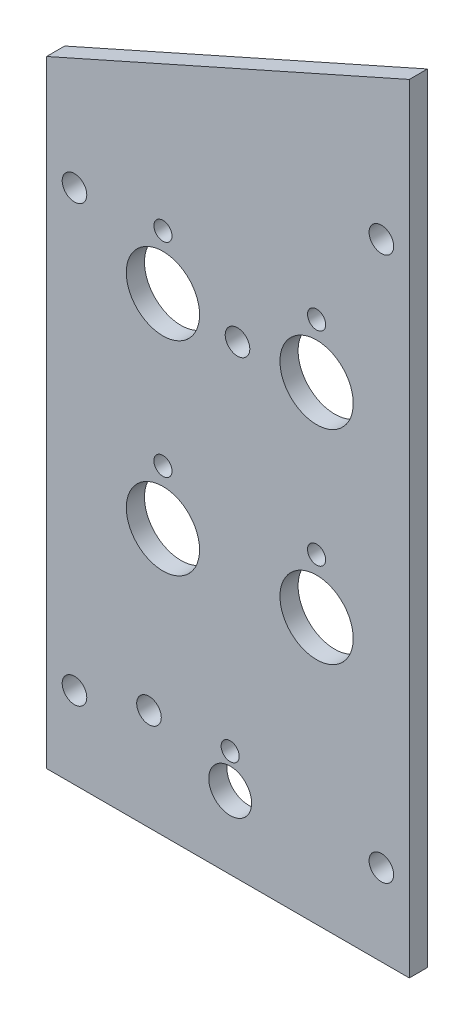
ISO-10303-21;
HEADER;
FILE_DESCRIPTION(('STEP AP214'),'2;1');
FILE_NAME('part.step','',(''),(''),'','','');
FILE_SCHEMA(('AUTOMOTIVE_DESIGN { 1 0 10303 214 1 1 1 1 }'));
ENDSEC;
DATA;
#1=APPLICATION_CONTEXT('core data for automotive mechanical design processes');
#2=APPLICATION_PROTOCOL_DEFINITION('international standard','automotive_design',2000,#1);
#3=PRODUCT_CONTEXT('',#1,'mechanical');
#4=PRODUCT('Part','Part','',(#3));
#5=PRODUCT_RELATED_PRODUCT_CATEGORY('part','',(#4));
#6=PRODUCT_DEFINITION_FORMATION('','',#4);
#7=PRODUCT_DEFINITION_CONTEXT('part definition',#1,'design');
#8=PRODUCT_DEFINITION('design','',#6,#7);
#9=PRODUCT_DEFINITION_SHAPE('','',#8);
#10=(LENGTH_UNIT() NAMED_UNIT(*) SI_UNIT(.MILLI.,.METRE.));
#11=(NAMED_UNIT(*) PLANE_ANGLE_UNIT() SI_UNIT($,.RADIAN.));
#12=(NAMED_UNIT(*) SI_UNIT($,.STERADIAN.) SOLID_ANGLE_UNIT());
#13=UNCERTAINTY_MEASURE_WITH_UNIT(LENGTH_MEASURE(1.E-05),#10,'distance_accuracy_value','');
#14=(GEOMETRIC_REPRESENTATION_CONTEXT(3) GLOBAL_UNCERTAINTY_ASSIGNED_CONTEXT((#13)) GLOBAL_UNIT_ASSIGNED_CONTEXT((#10,
#11,#12)) REPRESENTATION_CONTEXT('',''));
#15=CARTESIAN_POINT('',(0.,0.,0.));
#16=DIRECTION('',(0.,0.,1.));
#17=DIRECTION('',(1.,0.,0.));
#18=AXIS2_PLACEMENT_3D('',#15,#16,#17);
#19=CARTESIAN_POINT('',(63.5,136.2202,-3.175));
#20=DIRECTION('',(-0.406714772664201,0.913555194663523,0.));
#21=DIRECTION('',(-0.913555194663523,-0.406714772664201,0.));
#22=AXIS2_PLACEMENT_3D('',#19,#20,#21);
#23=PLANE('',#22);
#24=DIRECTION('',(-0.913555194663523,-0.406714772664201,0.));
#25=VECTOR('',#24,1.);
#26=CARTESIAN_POINT('',(63.5,136.2202,0.));
#27=LINE('',#26,#25);
#28=CARTESIAN_POINT('',(63.5,136.2202,0.));
#29=VERTEX_POINT('',#28);
#30=CARTESIAN_POINT('',(0.,107.95,0.));
#31=VERTEX_POINT('',#30);
#32=EDGE_CURVE('E105',#29,#31,#27,.T.);
#33=ORIENTED_EDGE('',*,*,#32,.F.);
#34=DIRECTION('',(0.,0.,1.));
#35=VECTOR('',#34,1.);
#36=CARTESIAN_POINT('',(63.5,136.2202,-3.175));
#37=LINE('',#36,#35);
#38=CARTESIAN_POINT('',(63.5,136.2202,-3.175));
#39=VERTEX_POINT('',#38);
#40=EDGE_CURVE('E11',#39,#29,#37,.T.);
#41=ORIENTED_EDGE('',*,*,#40,.F.);
#42=DIRECTION('',(-0.913555194663523,-0.406714772664201,0.));
#43=VECTOR('',#42,1.);
#44=CARTESIAN_POINT('',(63.5,136.2202,-3.175));
#45=LINE('',#44,#43);
#46=CARTESIAN_POINT('',(0.,107.95,-3.175));
#47=VERTEX_POINT('',#46);
#48=EDGE_CURVE('E98',#39,#47,#45,.T.);
#49=ORIENTED_EDGE('',*,*,#48,.T.);
#50=DIRECTION('',(0.,0.,1.));
#51=VECTOR('',#50,1.);
#52=CARTESIAN_POINT('',(0.,107.95,-3.175));
#53=LINE('',#52,#51);
#54=EDGE_CURVE('E43',#47,#31,#53,.T.);
#55=ORIENTED_EDGE('',*,*,#54,.T.);
#56=EDGE_LOOP('',(#33,#41,#49,#55));
#57=FACE_BOUND('',#56,.T.);
#58=ADVANCED_FACE('F40',(#57),#23,.T.);
#59=CARTESIAN_POINT('',(63.5,0.,-3.175));
#60=DIRECTION('',(1.,0.,0.));
#61=DIRECTION('',(0.,0.,-1.));
#62=AXIS2_PLACEMENT_3D('',#59,#60,#61);
#63=PLANE('',#62);
#64=DIRECTION('',(0.,1.,0.));
#65=VECTOR('',#64,1.);
#66=CARTESIAN_POINT('',(63.5,0.,0.));
#67=LINE('',#66,#65);
#68=CARTESIAN_POINT('',(63.5,0.,0.));
#69=VERTEX_POINT('',#68);
#70=EDGE_CURVE('E100',#69,#29,#67,.T.);
#71=ORIENTED_EDGE('',*,*,#70,.F.);
#72=DIRECTION('',(0.,0.,1.));
#73=VECTOR('',#72,1.);
#74=CARTESIAN_POINT('',(63.5,0.,-3.175));
#75=LINE('',#74,#73);
#76=CARTESIAN_POINT('',(63.5,0.,-3.175));
#77=VERTEX_POINT('',#76);
#78=EDGE_CURVE('E49',#77,#69,#75,.T.);
#79=ORIENTED_EDGE('',*,*,#78,.F.);
#80=DIRECTION('',(0.,1.,0.));
#81=VECTOR('',#80,1.);
#82=CARTESIAN_POINT('',(63.5,0.,-3.175));
#83=LINE('',#82,#81);
#84=EDGE_CURVE('E95',#77,#39,#83,.T.);
#85=ORIENTED_EDGE('',*,*,#84,.T.);
#86=ORIENTED_EDGE('',*,*,#40,.T.);
#87=EDGE_LOOP('',(#71,#79,#85,#86));
#88=FACE_BOUND('',#87,.T.);
#89=ADVANCED_FACE('F116',(#88),#63,.T.);
#90=CARTESIAN_POINT('',(0.,0.,-3.175));
#91=DIRECTION('',(0.,-1.,0.));
#92=DIRECTION('',(0.,0.,-1.));
#93=AXIS2_PLACEMENT_3D('',#90,#91,#92);
#94=PLANE('',#93);
#95=DIRECTION('',(1.,0.,0.));
#96=VECTOR('',#95,1.);
#97=CARTESIAN_POINT('',(0.,0.,0.));
#98=LINE('',#97,#96);
#99=CARTESIAN_POINT('',(0.,0.,0.));
#100=VERTEX_POINT('',#99);
#101=EDGE_CURVE('E90',#100,#69,#98,.T.);
#102=ORIENTED_EDGE('',*,*,#101,.F.);
#103=DIRECTION('',(0.,0.,1.));
#104=VECTOR('',#103,1.);
#105=CARTESIAN_POINT('',(0.,0.,-3.175));
#106=LINE('',#105,#104);
#107=CARTESIAN_POINT('',(0.,0.,-3.175));
#108=VERTEX_POINT('',#107);
#109=EDGE_CURVE('E85',#108,#100,#106,.T.);
#110=ORIENTED_EDGE('',*,*,#109,.F.);
#111=DIRECTION('',(1.,0.,0.));
#112=VECTOR('',#111,1.);
#113=CARTESIAN_POINT('',(0.,0.,-3.175));
#114=LINE('',#113,#112);
#115=EDGE_CURVE('E88',#108,#77,#114,.T.);
#116=ORIENTED_EDGE('',*,*,#115,.T.);
#117=ORIENTED_EDGE('',*,*,#78,.T.);
#118=EDGE_LOOP('',(#102,#110,#116,#117));
#119=FACE_BOUND('',#118,.T.);
#120=ADVANCED_FACE('F87',(#119),#94,.T.);
#121=CARTESIAN_POINT('',(0.,107.95,-3.175));
#122=DIRECTION('',(-1.,0.,0.));
#123=DIRECTION('',(0.,-1.,0.));
#124=AXIS2_PLACEMENT_3D('',#121,#122,#123);
#125=PLANE('',#124);
#126=DIRECTION('',(0.,-1.,0.));
#127=VECTOR('',#126,1.);
#128=CARTESIAN_POINT('',(0.,107.95,0.));
#129=LINE('',#128,#127);
#130=EDGE_CURVE('E108',#31,#100,#129,.T.);
#131=ORIENTED_EDGE('',*,*,#130,.F.);
#132=ORIENTED_EDGE('',*,*,#54,.F.);
#133=DIRECTION('',(0.,-1.,0.));
#134=VECTOR('',#133,1.);
#135=CARTESIAN_POINT('',(0.,107.95,-3.175));
#136=LINE('',#135,#134);
#137=EDGE_CURVE('E94',#47,#108,#136,.T.);
#138=ORIENTED_EDGE('',*,*,#137,.T.);
#139=ORIENTED_EDGE('',*,*,#109,.T.);
#140=EDGE_LOOP('',(#131,#132,#138,#139));
#141=FACE_BOUND('',#140,.T.);
#142=ADVANCED_FACE('F97',(#141),#125,.T.);
#143=CARTESIAN_POINT('',(0.,0.,-3.175));
#144=DIRECTION('',(0.,0.,1.));
#145=DIRECTION('',(1.,0.,0.));
#146=AXIS2_PLACEMENT_3D('',#143,#144,#145);
#147=PLANE('',#146);
#148=CARTESIAN_POINT('',(33.4263312126926,81.3833913233974,-3.175));
#149=DIRECTION('',(0.,0.,1.));
#150=DIRECTION('',(1.,0.,0.));
#151=AXIS2_PLACEMENT_3D('',#148,#149,#150);
#152=CIRCLE('',#151,2.15264999999999);
#153=CARTESIAN_POINT('',(35.5789812126926,81.3833913233974,-3.175));
#154=VERTEX_POINT('',#153);
#155=EDGE_CURVE('E209',#154,#154,#152,.T.);
#156=ORIENTED_EDGE('',*,*,#155,.T.);
#157=EDGE_LOOP('',(#156));
#158=FACE_BOUND('',#157,.T.);
#159=CARTESIAN_POINT('',(17.9313039319536,17.7712279582032,-3.175));
#160=DIRECTION('',(0.,0.,1.));
#161=DIRECTION('',(1.,0.,0.));
#162=AXIS2_PLACEMENT_3D('',#159,#160,#161);
#163=CIRCLE('',#162,2.15265);
#164=CARTESIAN_POINT('',(20.0839539319536,17.7712279582032,-3.175));
#165=VERTEX_POINT('',#164);
#166=EDGE_CURVE('E211',#165,#165,#163,.T.);
#167=ORIENTED_EDGE('',*,*,#166,.T.);
#168=EDGE_LOOP('',(#167));
#169=FACE_BOUND('',#168,.T.);
#170=CARTESIAN_POINT('',(20.3732306178551,91.7104238503903,-3.175));
#171=DIRECTION('',(0.,0.,1.));
#172=DIRECTION('',(1.,0.,0.));
#173=AXIS2_PLACEMENT_3D('',#170,#171,#172);
#174=CIRCLE('',#173,1.5875);
#175=CARTESIAN_POINT('',(21.9607306178551,91.7104238503903,-3.175));
#176=VERTEX_POINT('',#175);
#177=EDGE_CURVE('E245',#176,#176,#174,.T.);
#178=ORIENTED_EDGE('',*,*,#177,.T.);
#179=EDGE_LOOP('',(#178));
#180=FACE_BOUND('',#179,.T.);
#181=CARTESIAN_POINT('',(47.270485985733,56.0730061512906,-3.175));
#182=DIRECTION('',(0.,0.,1.));
#183=DIRECTION('',(1.,0.,0.));
#184=AXIS2_PLACEMENT_3D('',#181,#182,#183);
#185=CIRCLE('',#184,1.5875);
#186=CARTESIAN_POINT('',(48.857985985733,56.0730061512906,-3.175));
#187=VERTEX_POINT('',#186);
#188=EDGE_CURVE('E246',#187,#187,#185,.T.);
#189=ORIENTED_EDGE('',*,*,#188,.T.);
#190=EDGE_LOOP('',(#189));
#191=FACE_BOUND('',#190,.T.);
#192=CARTESIAN_POINT('',(20.3732306178551,56.0730061512906,-3.175));
#193=DIRECTION('',(0.,0.,1.));
#194=DIRECTION('',(1.,0.,0.));
#195=AXIS2_PLACEMENT_3D('',#192,#193,#194);
#196=CIRCLE('',#195,1.5875);
#197=CARTESIAN_POINT('',(21.9607306178551,56.0730061512906,-3.175));
#198=VERTEX_POINT('',#197);
#199=EDGE_CURVE('E253',#198,#198,#196,.T.);
#200=ORIENTED_EDGE('',*,*,#199,.T.);
#201=EDGE_LOOP('',(#200));
#202=FACE_BOUND('',#201,.T.);
#203=CARTESIAN_POINT('',(32.1439032,18.7,-3.175));
#204=DIRECTION('',(0.,0.,1.));
#205=DIRECTION('',(1.,0.,0.));
#206=AXIS2_PLACEMENT_3D('',#203,#204,#205);
#207=CIRCLE('',#206,1.5875);
#208=CARTESIAN_POINT('',(33.7314032,18.7,-3.175));
#209=VERTEX_POINT('',#208);
#210=EDGE_CURVE('E259',#209,#209,#207,.T.);
#211=ORIENTED_EDGE('',*,*,#210,.T.);
#212=EDGE_LOOP('',(#211));
#213=FACE_BOUND('',#212,.T.);
#214=CARTESIAN_POINT('',(32.1439032,12.7,-3.175));
#215=DIRECTION('',(0.,0.,1.));
#216=DIRECTION('',(1.,0.,0.));
#217=AXIS2_PLACEMENT_3D('',#214,#215,#216);
#218=CIRCLE('',#217,3.75000000000001);
#219=CARTESIAN_POINT('',(35.8939032,12.7,-3.175));
#220=VERTEX_POINT('',#219);
#221=EDGE_CURVE('E265',#220,#220,#218,.T.);
#222=ORIENTED_EDGE('',*,*,#221,.T.);
#223=EDGE_LOOP('',(#222));
#224=FACE_BOUND('',#223,.T.);
#225=CARTESIAN_POINT('',(47.270485985733,46.5480061512906,-3.175));
#226=DIRECTION('',(0.,0.,1.));
#227=DIRECTION('',(1.,0.,0.));
#228=AXIS2_PLACEMENT_3D('',#225,#226,#227);
#229=CIRCLE('',#228,6.4135);
#230=CARTESIAN_POINT('',(53.683985985733,46.5480061512906,-3.175));
#231=VERTEX_POINT('',#230);
#232=EDGE_CURVE('E220',#231,#231,#229,.T.);
#233=ORIENTED_EDGE('',*,*,#232,.T.);
#234=EDGE_LOOP('',(#233));
#235=FACE_BOUND('',#234,.T.);
#236=CARTESIAN_POINT('',(47.270485985733,82.1854238503903,-3.175));
#237=DIRECTION('',(0.,0.,1.));
#238=DIRECTION('',(1.,0.,0.));
#239=AXIS2_PLACEMENT_3D('',#236,#237,#238);
#240=CIRCLE('',#239,6.4135);
#241=CARTESIAN_POINT('',(53.683985985733,82.1854238503903,-3.175));
#242=VERTEX_POINT('',#241);
#243=EDGE_CURVE('E227',#242,#242,#240,.T.);
#244=ORIENTED_EDGE('',*,*,#243,.T.);
#245=EDGE_LOOP('',(#244));
#246=FACE_BOUND('',#245,.T.);
#247=CARTESIAN_POINT('',(20.3732306178551,82.1854238503903,-3.175));
#248=DIRECTION('',(0.,0.,1.));
#249=DIRECTION('',(1.,0.,0.));
#250=AXIS2_PLACEMENT_3D('',#247,#248,#249);
#251=CIRCLE('',#250,6.41350000000002);
#252=CARTESIAN_POINT('',(26.7867306178551,82.1854238503903,-3.175));
#253=VERTEX_POINT('',#252);
#254=EDGE_CURVE('E233',#253,#253,#251,.T.);
#255=ORIENTED_EDGE('',*,*,#254,.T.);
#256=EDGE_LOOP('',(#255));
#257=FACE_BOUND('',#256,.T.);
#258=CARTESIAN_POINT('',(20.3732306178551,46.5480061512906,-3.175));
#259=DIRECTION('',(0.,0.,1.));
#260=DIRECTION('',(1.,0.,0.));
#261=AXIS2_PLACEMENT_3D('',#258,#259,#260);
#262=CIRCLE('',#261,6.4135);
#263=CARTESIAN_POINT('',(26.7867306178551,46.5480061512906,-3.175));
#264=VERTEX_POINT('',#263);
#265=EDGE_CURVE('E239',#264,#264,#262,.T.);
#266=ORIENTED_EDGE('',*,*,#265,.T.);
#267=EDGE_LOOP('',(#266));
#268=FACE_BOUND('',#267,.T.);
#269=CARTESIAN_POINT('',(47.270485985733,91.7104238503903,-3.175));
#270=DIRECTION('',(0.,0.,1.));
#271=DIRECTION('',(1.,0.,0.));
#272=AXIS2_PLACEMENT_3D('',#269,#270,#271);
#273=CIRCLE('',#272,1.5875);
#274=CARTESIAN_POINT('',(48.857985985733,91.7104238503903,-3.175));
#275=VERTEX_POINT('',#274);
#276=EDGE_CURVE('E274',#275,#275,#273,.T.);
#277=ORIENTED_EDGE('',*,*,#276,.T.);
#278=EDGE_LOOP('',(#277));
#279=FACE_BOUND('',#278,.T.);
#280=CARTESIAN_POINT('',(58.6105,14.2875,-3.175));
#281=DIRECTION('',(0.,0.,1.));
#282=DIRECTION('',(1.,0.,0.));
#283=AXIS2_PLACEMENT_3D('',#280,#281,#282);
#284=CIRCLE('',#283,2.15265);
#285=CARTESIAN_POINT('',(60.76315,14.2875,-3.175));
#286=VERTEX_POINT('',#285);
#287=EDGE_CURVE('E282',#286,#286,#284,.T.);
#288=ORIENTED_EDGE('',*,*,#287,.T.);
#289=EDGE_LOOP('',(#288));
#290=FACE_BOUND('',#289,.T.);
#291=CARTESIAN_POINT('',(4.8895,14.2875,-3.175));
#292=DIRECTION('',(0.,0.,1.));
#293=DIRECTION('',(1.,0.,0.));
#294=AXIS2_PLACEMENT_3D('',#291,#292,#293);
#295=CIRCLE('',#294,2.15265);
#296=CARTESIAN_POINT('',(7.04215,14.2875,-3.175));
#297=VERTEX_POINT('',#296);
#298=EDGE_CURVE('E288',#297,#297,#295,.T.);
#299=ORIENTED_EDGE('',*,*,#298,.T.);
#300=EDGE_LOOP('',(#299));
#301=FACE_BOUND('',#300,.T.);
#302=CARTESIAN_POINT('',(4.8895,90.4875,-3.175));
#303=DIRECTION('',(0.,0.,1.));
#304=DIRECTION('',(1.,0.,0.));
#305=AXIS2_PLACEMENT_3D('',#302,#303,#304);
#306=CIRCLE('',#305,2.15265);
#307=CARTESIAN_POINT('',(7.04215,90.4875,-3.175));
#308=VERTEX_POINT('',#307);
#309=EDGE_CURVE('E294',#308,#308,#306,.T.);
#310=ORIENTED_EDGE('',*,*,#309,.T.);
#311=EDGE_LOOP('',(#310));
#312=FACE_BOUND('',#311,.T.);
#313=CARTESIAN_POINT('',(58.6105,109.5375,-3.175));
#314=DIRECTION('',(0.,0.,1.));
#315=DIRECTION('',(1.,0.,0.));
#316=AXIS2_PLACEMENT_3D('',#313,#314,#315);
#317=CIRCLE('',#316,2.15265);
#318=CARTESIAN_POINT('',(60.76315,109.5375,-3.175));
#319=VERTEX_POINT('',#318);
#320=EDGE_CURVE('E109',#319,#319,#317,.T.);
#321=ORIENTED_EDGE('',*,*,#320,.T.);
#322=EDGE_LOOP('',(#321));
#323=FACE_BOUND('',#322,.T.);
#324=ORIENTED_EDGE('',*,*,#48,.F.);
#325=ORIENTED_EDGE('',*,*,#84,.F.);
#326=ORIENTED_EDGE('',*,*,#115,.F.);
#327=ORIENTED_EDGE('',*,*,#137,.F.);
#328=EDGE_LOOP('',(#324,#325,#326,#327));
#329=FACE_BOUND('',#328,.T.);
#330=ADVANCED_FACE('F93',(#158,#169,#180,#191,#202,#213,#224,#235,#246,#257,#268,#279,#290,#301,
#312,#323,#329),#147,.F.);
#331=CARTESIAN_POINT('',(0.,0.,0.));
#332=DIRECTION('',(0.,0.,1.));
#333=DIRECTION('',(1.,0.,0.));
#334=AXIS2_PLACEMENT_3D('',#331,#332,#333);
#335=PLANE('',#334);
#336=CARTESIAN_POINT('',(33.4263312126926,81.3833913233974,0.));
#337=DIRECTION('',(0.,0.,1.));
#338=DIRECTION('',(1.,0.,0.));
#339=AXIS2_PLACEMENT_3D('',#336,#337,#338);
#340=CIRCLE('',#339,2.15264999999999);
#341=CARTESIAN_POINT('',(35.5789812126926,81.3833913233974,0.));
#342=VERTEX_POINT('',#341);
#343=EDGE_CURVE('E207',#342,#342,#340,.T.);
#344=ORIENTED_EDGE('',*,*,#343,.F.);
#345=EDGE_LOOP('',(#344));
#346=FACE_BOUND('',#345,.T.);
#347=CARTESIAN_POINT('',(17.9313039319536,17.7712279582032,0.));
#348=DIRECTION('',(0.,0.,1.));
#349=DIRECTION('',(1.,0.,0.));
#350=AXIS2_PLACEMENT_3D('',#347,#348,#349);
#351=CIRCLE('',#350,2.15264999999999);
#352=CARTESIAN_POINT('',(20.0839539319536,17.7712279582032,0.));
#353=VERTEX_POINT('',#352);
#354=EDGE_CURVE('E216',#353,#353,#351,.T.);
#355=ORIENTED_EDGE('',*,*,#354,.F.);
#356=EDGE_LOOP('',(#355));
#357=FACE_BOUND('',#356,.T.);
#358=CARTESIAN_POINT('',(20.3732306178551,91.7104238503903,0.));
#359=DIRECTION('',(0.,0.,1.));
#360=DIRECTION('',(1.,0.,0.));
#361=AXIS2_PLACEMENT_3D('',#358,#359,#360);
#362=CIRCLE('',#361,1.5875);
#363=CARTESIAN_POINT('',(21.9607306178551,91.7104238503903,0.));
#364=VERTEX_POINT('',#363);
#365=EDGE_CURVE('E219',#364,#364,#362,.T.);
#366=ORIENTED_EDGE('',*,*,#365,.F.);
#367=EDGE_LOOP('',(#366));
#368=FACE_BOUND('',#367,.T.);
#369=CARTESIAN_POINT('',(47.270485985733,56.0730061512906,0.));
#370=DIRECTION('',(0.,0.,1.));
#371=DIRECTION('',(1.,0.,0.));
#372=AXIS2_PLACEMENT_3D('',#369,#370,#371);
#373=CIRCLE('',#372,1.5875);
#374=CARTESIAN_POINT('',(48.857985985733,56.0730061512906,0.));
#375=VERTEX_POINT('',#374);
#376=EDGE_CURVE('E250',#375,#375,#373,.T.);
#377=ORIENTED_EDGE('',*,*,#376,.F.);
#378=EDGE_LOOP('',(#377));
#379=FACE_BOUND('',#378,.T.);
#380=CARTESIAN_POINT('',(20.3732306178551,56.0730061512906,0.));
#381=DIRECTION('',(0.,0.,1.));
#382=DIRECTION('',(1.,0.,0.));
#383=AXIS2_PLACEMENT_3D('',#380,#381,#382);
#384=CIRCLE('',#383,1.5875);
#385=CARTESIAN_POINT('',(21.9607306178551,56.0730061512906,0.));
#386=VERTEX_POINT('',#385);
#387=EDGE_CURVE('E256',#386,#386,#384,.T.);
#388=ORIENTED_EDGE('',*,*,#387,.F.);
#389=EDGE_LOOP('',(#388));
#390=FACE_BOUND('',#389,.T.);
#391=CARTESIAN_POINT('',(32.1439032,18.7,0.));
#392=DIRECTION('',(0.,0.,1.));
#393=DIRECTION('',(1.,0.,0.));
#394=AXIS2_PLACEMENT_3D('',#391,#392,#393);
#395=CIRCLE('',#394,1.5875);
#396=CARTESIAN_POINT('',(33.7314032,18.7,0.));
#397=VERTEX_POINT('',#396);
#398=EDGE_CURVE('E262',#397,#397,#395,.T.);
#399=ORIENTED_EDGE('',*,*,#398,.F.);
#400=EDGE_LOOP('',(#399));
#401=FACE_BOUND('',#400,.T.);
#402=CARTESIAN_POINT('',(32.1439032,12.7,0.));
#403=DIRECTION('',(0.,0.,1.));
#404=DIRECTION('',(1.,0.,0.));
#405=AXIS2_PLACEMENT_3D('',#402,#403,#404);
#406=CIRCLE('',#405,3.75000000000001);
#407=CARTESIAN_POINT('',(35.8939032,12.7,0.));
#408=VERTEX_POINT('',#407);
#409=EDGE_CURVE('E223',#408,#408,#406,.T.);
#410=ORIENTED_EDGE('',*,*,#409,.F.);
#411=EDGE_LOOP('',(#410));
#412=FACE_BOUND('',#411,.T.);
#413=CARTESIAN_POINT('',(47.270485985733,46.5480061512906,0.));
#414=DIRECTION('',(0.,0.,1.));
#415=DIRECTION('',(1.,0.,0.));
#416=AXIS2_PLACEMENT_3D('',#413,#414,#415);
#417=CIRCLE('',#416,6.4135);
#418=CARTESIAN_POINT('',(53.683985985733,46.5480061512906,0.));
#419=VERTEX_POINT('',#418);
#420=EDGE_CURVE('E224',#419,#419,#417,.T.);
#421=ORIENTED_EDGE('',*,*,#420,.F.);
#422=EDGE_LOOP('',(#421));
#423=FACE_BOUND('',#422,.T.);
#424=CARTESIAN_POINT('',(47.270485985733,82.1854238503903,0.));
#425=DIRECTION('',(0.,0.,1.));
#426=DIRECTION('',(1.,0.,0.));
#427=AXIS2_PLACEMENT_3D('',#424,#425,#426);
#428=CIRCLE('',#427,6.4135);
#429=CARTESIAN_POINT('',(53.683985985733,82.1854238503903,0.));
#430=VERTEX_POINT('',#429);
#431=EDGE_CURVE('E230',#430,#430,#428,.T.);
#432=ORIENTED_EDGE('',*,*,#431,.F.);
#433=EDGE_LOOP('',(#432));
#434=FACE_BOUND('',#433,.T.);
#435=CARTESIAN_POINT('',(20.3732306178551,82.1854238503903,0.));
#436=DIRECTION('',(0.,0.,1.));
#437=DIRECTION('',(1.,0.,0.));
#438=AXIS2_PLACEMENT_3D('',#435,#436,#437);
#439=CIRCLE('',#438,6.41350000000002);
#440=CARTESIAN_POINT('',(26.7867306178551,82.1854238503903,0.));
#441=VERTEX_POINT('',#440);
#442=EDGE_CURVE('E236',#441,#441,#439,.T.);
#443=ORIENTED_EDGE('',*,*,#442,.F.);
#444=EDGE_LOOP('',(#443));
#445=FACE_BOUND('',#444,.T.);
#446=CARTESIAN_POINT('',(20.3732306178551,46.5480061512906,0.));
#447=DIRECTION('',(0.,0.,1.));
#448=DIRECTION('',(1.,0.,0.));
#449=AXIS2_PLACEMENT_3D('',#446,#447,#448);
#450=CIRCLE('',#449,6.4135);
#451=CARTESIAN_POINT('',(26.7867306178551,46.5480061512906,0.));
#452=VERTEX_POINT('',#451);
#453=EDGE_CURVE('E242',#452,#452,#450,.T.);
#454=ORIENTED_EDGE('',*,*,#453,.F.);
#455=EDGE_LOOP('',(#454));
#456=FACE_BOUND('',#455,.T.);
#457=CARTESIAN_POINT('',(47.270485985733,91.7104238503903,0.));
#458=DIRECTION('',(0.,0.,1.));
#459=DIRECTION('',(1.,0.,0.));
#460=AXIS2_PLACEMENT_3D('',#457,#458,#459);
#461=CIRCLE('',#460,1.5875);
#462=CARTESIAN_POINT('',(48.857985985733,91.7104238503903,0.));
#463=VERTEX_POINT('',#462);
#464=EDGE_CURVE('E249',#463,#463,#461,.T.);
#465=ORIENTED_EDGE('',*,*,#464,.F.);
#466=EDGE_LOOP('',(#465));
#467=FACE_BOUND('',#466,.T.);
#468=CARTESIAN_POINT('',(58.6105,14.2875,0.));
#469=DIRECTION('',(0.,0.,1.));
#470=DIRECTION('',(1.,0.,0.));
#471=AXIS2_PLACEMENT_3D('',#468,#469,#470);
#472=CIRCLE('',#471,2.15264999999999);
#473=CARTESIAN_POINT('',(60.76315,14.2875,0.));
#474=VERTEX_POINT('',#473);
#475=EDGE_CURVE('E277',#474,#474,#472,.T.);
#476=ORIENTED_EDGE('',*,*,#475,.F.);
#477=EDGE_LOOP('',(#476));
#478=FACE_BOUND('',#477,.T.);
#479=CARTESIAN_POINT('',(4.8895,14.2875,0.));
#480=DIRECTION('',(0.,0.,1.));
#481=DIRECTION('',(1.,0.,0.));
#482=AXIS2_PLACEMENT_3D('',#479,#480,#481);
#483=CIRCLE('',#482,2.15264999999999);
#484=CARTESIAN_POINT('',(7.04214999999999,14.2875,0.));
#485=VERTEX_POINT('',#484);
#486=EDGE_CURVE('E285',#485,#485,#483,.T.);
#487=ORIENTED_EDGE('',*,*,#486,.F.);
#488=EDGE_LOOP('',(#487));
#489=FACE_BOUND('',#488,.T.);
#490=CARTESIAN_POINT('',(4.8895,90.4875,0.));
#491=DIRECTION('',(0.,0.,1.));
#492=DIRECTION('',(1.,0.,0.));
#493=AXIS2_PLACEMENT_3D('',#490,#491,#492);
#494=CIRCLE('',#493,2.15264999999999);
#495=CARTESIAN_POINT('',(7.04214999999999,90.4875,0.));
#496=VERTEX_POINT('',#495);
#497=EDGE_CURVE('E291',#496,#496,#494,.T.);
#498=ORIENTED_EDGE('',*,*,#497,.F.);
#499=EDGE_LOOP('',(#498));
#500=FACE_BOUND('',#499,.T.);
#501=CARTESIAN_POINT('',(58.6105,109.5375,0.));
#502=DIRECTION('',(0.,0.,1.));
#503=DIRECTION('',(1.,0.,0.));
#504=AXIS2_PLACEMENT_3D('',#501,#502,#503);
#505=CIRCLE('',#504,2.15264999999999);
#506=CARTESIAN_POINT('',(60.76315,109.5375,0.));
#507=VERTEX_POINT('',#506);
#508=EDGE_CURVE('E297',#507,#507,#505,.T.);
#509=ORIENTED_EDGE('',*,*,#508,.F.);
#510=EDGE_LOOP('',(#509));
#511=FACE_BOUND('',#510,.T.);
#512=ORIENTED_EDGE('',*,*,#32,.T.);
#513=ORIENTED_EDGE('',*,*,#130,.T.);
#514=ORIENTED_EDGE('',*,*,#101,.T.);
#515=ORIENTED_EDGE('',*,*,#70,.T.);
#516=EDGE_LOOP('',(#512,#513,#514,#515));
#517=FACE_BOUND('',#516,.T.);
#518=ADVANCED_FACE('F115',(#346,#357,#368,#379,#390,#401,#412,#423,#434,#445,#456,#467,#478,
#489,#500,#511,#517),#335,.T.);
#519=CARTESIAN_POINT('',(58.6105,109.5375,0.));
#520=DIRECTION('',(0.,0.,1.));
#521=DIRECTION('',(1.,0.,0.));
#522=AXIS2_PLACEMENT_3D('',#519,#520,#521);
#523=CYLINDRICAL_SURFACE('',#522,2.15264999999999);
#524=ORIENTED_EDGE('',*,*,#320,.F.);
#525=EDGE_LOOP('',(#524));
#526=FACE_BOUND('',#525,.T.);
#527=ORIENTED_EDGE('',*,*,#508,.T.);
#528=EDGE_LOOP('',(#527));
#529=FACE_BOUND('',#528,.T.);
#530=ADVANCED_FACE('F135',(#526,#529),#523,.F.);
#531=CARTESIAN_POINT('',(4.8895,90.4875,0.));
#532=DIRECTION('',(0.,0.,1.));
#533=DIRECTION('',(1.,0.,0.));
#534=AXIS2_PLACEMENT_3D('',#531,#532,#533);
#535=CYLINDRICAL_SURFACE('',#534,2.15264999999999);
#536=ORIENTED_EDGE('',*,*,#309,.F.);
#537=EDGE_LOOP('',(#536));
#538=FACE_BOUND('',#537,.T.);
#539=ORIENTED_EDGE('',*,*,#497,.T.);
#540=EDGE_LOOP('',(#539));
#541=FACE_BOUND('',#540,.T.);
#542=ADVANCED_FACE('F142',(#538,#541),#535,.F.);
#543=CARTESIAN_POINT('',(4.8895,14.2875,0.));
#544=DIRECTION('',(0.,0.,1.));
#545=DIRECTION('',(1.,0.,0.));
#546=AXIS2_PLACEMENT_3D('',#543,#544,#545);
#547=CYLINDRICAL_SURFACE('',#546,2.15264999999999);
#548=ORIENTED_EDGE('',*,*,#298,.F.);
#549=EDGE_LOOP('',(#548));
#550=FACE_BOUND('',#549,.T.);
#551=ORIENTED_EDGE('',*,*,#486,.T.);
#552=EDGE_LOOP('',(#551));
#553=FACE_BOUND('',#552,.T.);
#554=ADVANCED_FACE('F146',(#550,#553),#547,.F.);
#555=CARTESIAN_POINT('',(58.6105,14.2875,0.));
#556=DIRECTION('',(0.,0.,1.));
#557=DIRECTION('',(1.,0.,0.));
#558=AXIS2_PLACEMENT_3D('',#555,#556,#557);
#559=CYLINDRICAL_SURFACE('',#558,2.15264999999999);
#560=ORIENTED_EDGE('',*,*,#287,.F.);
#561=EDGE_LOOP('',(#560));
#562=FACE_BOUND('',#561,.T.);
#563=ORIENTED_EDGE('',*,*,#475,.T.);
#564=EDGE_LOOP('',(#563));
#565=FACE_BOUND('',#564,.T.);
#566=ADVANCED_FACE('F150',(#562,#565),#559,.F.);
#567=CARTESIAN_POINT('',(47.270485985733,91.7104238503903,-3.175));
#568=DIRECTION('',(0.,0.,1.));
#569=DIRECTION('',(1.,0.,0.));
#570=AXIS2_PLACEMENT_3D('',#567,#568,#569);
#571=CYLINDRICAL_SURFACE('',#570,1.5875);
#572=ORIENTED_EDGE('',*,*,#276,.F.);
#573=EDGE_LOOP('',(#572));
#574=FACE_BOUND('',#573,.T.);
#575=ORIENTED_EDGE('',*,*,#464,.T.);
#576=EDGE_LOOP('',(#575));
#577=FACE_BOUND('',#576,.T.);
#578=ADVANCED_FACE('F154',(#574,#577),#571,.F.);
#579=CARTESIAN_POINT('',(20.3732306178551,46.5480061512906,-3.175));
#580=DIRECTION('',(0.,0.,1.));
#581=DIRECTION('',(1.,0.,0.));
#582=AXIS2_PLACEMENT_3D('',#579,#580,#581);
#583=CYLINDRICAL_SURFACE('',#582,6.4135);
#584=ORIENTED_EDGE('',*,*,#265,.F.);
#585=EDGE_LOOP('',(#584));
#586=FACE_BOUND('',#585,.T.);
#587=ORIENTED_EDGE('',*,*,#453,.T.);
#588=EDGE_LOOP('',(#587));
#589=FACE_BOUND('',#588,.T.);
#590=ADVANCED_FACE('F158',(#586,#589),#583,.F.);
#591=CARTESIAN_POINT('',(20.3732306178551,82.1854238503903,-3.175));
#592=DIRECTION('',(0.,0.,1.));
#593=DIRECTION('',(1.,0.,0.));
#594=AXIS2_PLACEMENT_3D('',#591,#592,#593);
#595=CYLINDRICAL_SURFACE('',#594,6.41350000000002);
#596=ORIENTED_EDGE('',*,*,#254,.F.);
#597=EDGE_LOOP('',(#596));
#598=FACE_BOUND('',#597,.T.);
#599=ORIENTED_EDGE('',*,*,#442,.T.);
#600=EDGE_LOOP('',(#599));
#601=FACE_BOUND('',#600,.T.);
#602=ADVANCED_FACE('F184',(#598,#601),#595,.F.);
#603=CARTESIAN_POINT('',(47.270485985733,82.1854238503903,-3.175));
#604=DIRECTION('',(0.,0.,1.));
#605=DIRECTION('',(1.,0.,0.));
#606=AXIS2_PLACEMENT_3D('',#603,#604,#605);
#607=CYLINDRICAL_SURFACE('',#606,6.4135);
#608=ORIENTED_EDGE('',*,*,#243,.F.);
#609=EDGE_LOOP('',(#608));
#610=FACE_BOUND('',#609,.T.);
#611=ORIENTED_EDGE('',*,*,#431,.T.);
#612=EDGE_LOOP('',(#611));
#613=FACE_BOUND('',#612,.T.);
#614=ADVANCED_FACE('F188',(#610,#613),#607,.F.);
#615=CARTESIAN_POINT('',(47.270485985733,46.5480061512906,-3.175));
#616=DIRECTION('',(0.,0.,1.));
#617=DIRECTION('',(1.,0.,0.));
#618=AXIS2_PLACEMENT_3D('',#615,#616,#617);
#619=CYLINDRICAL_SURFACE('',#618,6.4135);
#620=ORIENTED_EDGE('',*,*,#232,.F.);
#621=EDGE_LOOP('',(#620));
#622=FACE_BOUND('',#621,.T.);
#623=ORIENTED_EDGE('',*,*,#420,.T.);
#624=EDGE_LOOP('',(#623));
#625=FACE_BOUND('',#624,.T.);
#626=ADVANCED_FACE('F170',(#622,#625),#619,.F.);
#627=CARTESIAN_POINT('',(32.1439032,12.7,-3.175));
#628=DIRECTION('',(0.,0.,1.));
#629=DIRECTION('',(1.,0.,0.));
#630=AXIS2_PLACEMENT_3D('',#627,#628,#629);
#631=CYLINDRICAL_SURFACE('',#630,3.75000000000001);
#632=ORIENTED_EDGE('',*,*,#221,.F.);
#633=EDGE_LOOP('',(#632));
#634=FACE_BOUND('',#633,.T.);
#635=ORIENTED_EDGE('',*,*,#409,.T.);
#636=EDGE_LOOP('',(#635));
#637=FACE_BOUND('',#636,.T.);
#638=ADVANCED_FACE('F166',(#634,#637),#631,.F.);
#639=CARTESIAN_POINT('',(32.1439032,18.7,-3.175));
#640=DIRECTION('',(0.,0.,1.));
#641=DIRECTION('',(1.,0.,0.));
#642=AXIS2_PLACEMENT_3D('',#639,#640,#641);
#643=CYLINDRICAL_SURFACE('',#642,1.5875);
#644=ORIENTED_EDGE('',*,*,#210,.F.);
#645=EDGE_LOOP('',(#644));
#646=FACE_BOUND('',#645,.T.);
#647=ORIENTED_EDGE('',*,*,#398,.T.);
#648=EDGE_LOOP('',(#647));
#649=FACE_BOUND('',#648,.T.);
#650=ADVANCED_FACE('F169',(#646,#649),#643,.F.);
#651=CARTESIAN_POINT('',(20.3732306178551,56.0730061512906,-3.175));
#652=DIRECTION('',(0.,0.,1.));
#653=DIRECTION('',(1.,0.,0.));
#654=AXIS2_PLACEMENT_3D('',#651,#652,#653);
#655=CYLINDRICAL_SURFACE('',#654,1.5875);
#656=ORIENTED_EDGE('',*,*,#199,.F.);
#657=EDGE_LOOP('',(#656));
#658=FACE_BOUND('',#657,.T.);
#659=ORIENTED_EDGE('',*,*,#387,.T.);
#660=EDGE_LOOP('',(#659));
#661=FACE_BOUND('',#660,.T.);
#662=ADVANCED_FACE('F174',(#658,#661),#655,.F.);
#663=CARTESIAN_POINT('',(47.270485985733,56.0730061512906,-3.175));
#664=DIRECTION('',(0.,0.,1.));
#665=DIRECTION('',(1.,0.,0.));
#666=AXIS2_PLACEMENT_3D('',#663,#664,#665);
#667=CYLINDRICAL_SURFACE('',#666,1.5875);
#668=ORIENTED_EDGE('',*,*,#188,.F.);
#669=EDGE_LOOP('',(#668));
#670=FACE_BOUND('',#669,.T.);
#671=ORIENTED_EDGE('',*,*,#376,.T.);
#672=EDGE_LOOP('',(#671));
#673=FACE_BOUND('',#672,.T.);
#674=ADVANCED_FACE('F164',(#670,#673),#667,.F.);
#675=CARTESIAN_POINT('',(20.3732306178551,91.7104238503903,-3.175));
#676=DIRECTION('',(0.,0.,1.));
#677=DIRECTION('',(1.,0.,0.));
#678=AXIS2_PLACEMENT_3D('',#675,#676,#677);
#679=CYLINDRICAL_SURFACE('',#678,1.5875);
#680=ORIENTED_EDGE('',*,*,#177,.F.);
#681=EDGE_LOOP('',(#680));
#682=FACE_BOUND('',#681,.T.);
#683=ORIENTED_EDGE('',*,*,#365,.T.);
#684=EDGE_LOOP('',(#683));
#685=FACE_BOUND('',#684,.T.);
#686=ADVANCED_FACE('F160',(#682,#685),#679,.F.);
#687=CARTESIAN_POINT('',(17.9313039319536,17.7712279582032,6.35));
#688=DIRECTION('',(0.,0.,1.));
#689=DIRECTION('',(1.,0.,0.));
#690=AXIS2_PLACEMENT_3D('',#687,#688,#689);
#691=CYLINDRICAL_SURFACE('',#690,2.15264999999999);
#692=ORIENTED_EDGE('',*,*,#354,.T.);
#693=EDGE_LOOP('',(#692));
#694=FACE_BOUND('',#693,.T.);
#695=ORIENTED_EDGE('',*,*,#166,.F.);
#696=EDGE_LOOP('',(#695));
#697=FACE_BOUND('',#696,.T.);
#698=ADVANCED_FACE('F163',(#694,#697),#691,.F.);
#699=CARTESIAN_POINT('',(33.4263312126926,81.3833913233974,6.35));
#700=DIRECTION('',(0.,0.,1.));
#701=DIRECTION('',(1.,0.,0.));
#702=AXIS2_PLACEMENT_3D('',#699,#700,#701);
#703=CYLINDRICAL_SURFACE('',#702,2.15264999999999);
#704=ORIENTED_EDGE('',*,*,#343,.T.);
#705=EDGE_LOOP('',(#704));
#706=FACE_BOUND('',#705,.T.);
#707=ORIENTED_EDGE('',*,*,#155,.F.);
#708=EDGE_LOOP('',(#707));
#709=FACE_BOUND('',#708,.T.);
#710=ADVANCED_FACE('F198',(#706,#709),#703,.F.);
#711=CLOSED_SHELL('',(#58,#89,#120,#142,#330,#518,#530,#542,#554,#566,#578,#590,#602,#614,#626,
#638,#650,#662,#674,#686,#698,#710));
#712=MANIFOLD_SOLID_BREP('B2',#711);
#713=ADVANCED_BREP_SHAPE_REPRESENTATION('',(#18,#712),#14);
#714=SHAPE_DEFINITION_REPRESENTATION(#9,#713);
ENDSEC;
END-ISO-10303-21;
